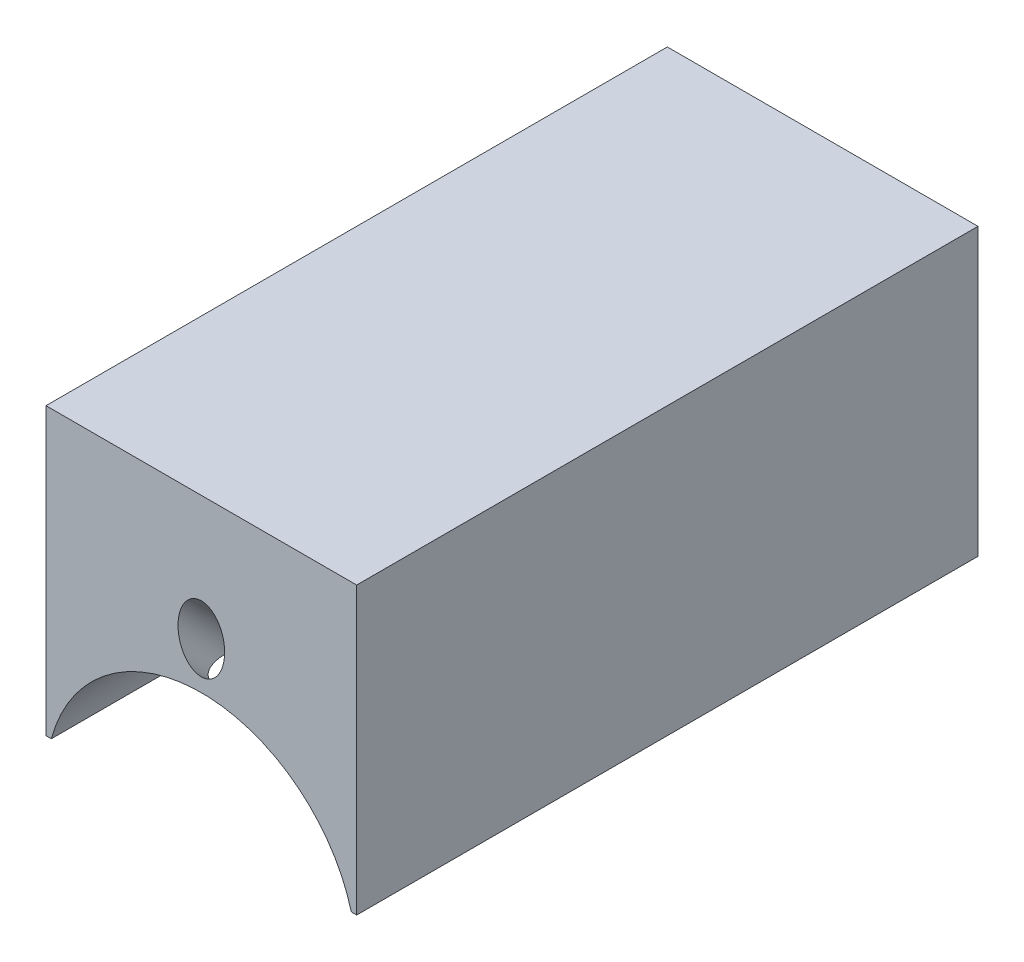
ISO-10303-21;
HEADER;
FILE_DESCRIPTION(('STEP AP214'),'2;1');
FILE_NAME('part.step','',(''),(''),'','','');
FILE_SCHEMA(('AUTOMOTIVE_DESIGN { 1 0 10303 214 1 1 1 1 }'));
ENDSEC;
DATA;
#1=APPLICATION_CONTEXT('core data for automotive mechanical design processes');
#2=APPLICATION_PROTOCOL_DEFINITION('international standard','automotive_design',2000,#1);
#3=PRODUCT_CONTEXT('',#1,'mechanical');
#4=PRODUCT('Part','Part','',(#3));
#5=PRODUCT_RELATED_PRODUCT_CATEGORY('part','',(#4));
#6=PRODUCT_DEFINITION_FORMATION('','',#4);
#7=PRODUCT_DEFINITION_CONTEXT('part definition',#1,'design');
#8=PRODUCT_DEFINITION('design','',#6,#7);
#9=PRODUCT_DEFINITION_SHAPE('','',#8);
#10=(LENGTH_UNIT() NAMED_UNIT(*) SI_UNIT(.MILLI.,.METRE.));
#11=(NAMED_UNIT(*) PLANE_ANGLE_UNIT() SI_UNIT($,.RADIAN.));
#12=(NAMED_UNIT(*) SI_UNIT($,.STERADIAN.) SOLID_ANGLE_UNIT());
#13=UNCERTAINTY_MEASURE_WITH_UNIT(LENGTH_MEASURE(1.E-05),#10,'distance_accuracy_value','');
#14=(GEOMETRIC_REPRESENTATION_CONTEXT(3) GLOBAL_UNCERTAINTY_ASSIGNED_CONTEXT((#13)) GLOBAL_UNIT_ASSIGNED_CONTEXT((#10,
#11,#12)) REPRESENTATION_CONTEXT('',''));
#15=CARTESIAN_POINT('',(0.,0.,0.));
#16=DIRECTION('',(0.,0.,1.));
#17=DIRECTION('',(1.,0.,0.));
#18=AXIS2_PLACEMENT_3D('',#15,#16,#17);
#19=CARTESIAN_POINT('',(0.,-8.55267423014587,40.));
#20=DIRECTION('',(0.,0.,-1.));
#21=DIRECTION('',(-1.,0.,0.));
#22=AXIS2_PLACEMENT_3D('',#19,#20,#21);
#23=CYLINDRICAL_SURFACE('',#22,10.);
#24=CARTESIAN_POINT('',(0.,-8.55267423014587,0.));
#25=DIRECTION('',(0.,0.,1.));
#26=DIRECTION('',(1.,0.,0.));
#27=AXIS2_PLACEMENT_3D('',#24,#25,#26);
#28=CIRCLE('',#27,10.);
#29=CARTESIAN_POINT('',(9.65608616365866,-5.95267423014586,0.));
#30=VERTEX_POINT('',#29);
#31=CARTESIAN_POINT('',(-9.65608616365865,-5.95267423014586,0.));
#32=VERTEX_POINT('',#31);
#33=EDGE_CURVE('E132',#30,#32,#28,.T.);
#34=ORIENTED_EDGE('',*,*,#33,.F.);
#35=DIRECTION('',(0.,0.,-1.));
#36=VECTOR('',#35,1.);
#37=CARTESIAN_POINT('',(9.65608616365866,-5.95267423014586,40.));
#38=LINE('',#37,#36);
#39=CARTESIAN_POINT('',(9.65608616365866,-5.95267423014586,40.));
#40=VERTEX_POINT('',#39);
#41=EDGE_CURVE('E11',#40,#30,#38,.T.);
#42=ORIENTED_EDGE('',*,*,#41,.F.);
#43=CARTESIAN_POINT('',(0.,-8.55267423014587,40.));
#44=DIRECTION('',(0.,0.,1.));
#45=DIRECTION('',(1.,0.,0.));
#46=AXIS2_PLACEMENT_3D('',#43,#44,#45);
#47=CIRCLE('',#46,10.);
#48=CARTESIAN_POINT('',(-9.65608616365865,-5.95267423014586,40.));
#49=VERTEX_POINT('',#48);
#50=EDGE_CURVE('E146',#40,#49,#47,.T.);
#51=ORIENTED_EDGE('',*,*,#50,.T.);
#52=DIRECTION('',(0.,0.,-1.));
#53=VECTOR('',#52,1.);
#54=CARTESIAN_POINT('',(-9.65608616365865,-5.95267423014586,40.));
#55=LINE('',#54,#53);
#56=EDGE_CURVE('E94',#49,#32,#55,.T.);
#57=ORIENTED_EDGE('',*,*,#56,.T.);
#58=EDGE_LOOP('',(#34,#42,#51,#57));
#59=FACE_BOUND('',#58,.T.);
#60=CARTESIAN_POINT('',(0.,1.44732576985414,39.1213203435597));
#61=CARTESIAN_POINT('',(-0.0635989039507122,1.44732544703079,39.1213177514824));
#62=CARTESIAN_POINT('',(-0.127207495527335,1.44671054681537,39.1149278056126));
#63=CARTESIAN_POINT('',(-0.252007458588344,1.44434557128128,39.0900860557695));
#64=CARTESIAN_POINT('',(-0.313196086451996,1.44259424459475,39.0716209551515));
#65=CARTESIAN_POINT('',(-0.430806163939058,1.43821402272902,39.0246357296502));
#66=CARTESIAN_POINT('',(-0.487266234041388,1.43559333478637,38.9962095067688));
#67=CARTESIAN_POINT('',(-0.595237629720515,1.42974135277948,38.9312868516016));
#68=CARTESIAN_POINT('',(-0.646746610227041,1.4265097714961,38.8947866218413));
#69=CARTESIAN_POINT('',(-0.770499010242282,1.41788112581076,38.7945440035535));
#70=CARTESIAN_POINT('',(-0.839313474722218,1.4122422244431,38.7265991010686));
#71=CARTESIAN_POINT('',(-0.96549604851506,1.400809416659,38.5808016468058));
#72=CARTESIAN_POINT('',(-1.02283229707522,1.39501512806165,38.5029224734083));
#73=CARTESIAN_POINT('',(-1.15199733435805,1.38105441570815,38.301307366688));
#74=CARTESIAN_POINT('',(-1.21753240423799,1.3730875089874,38.1735320055996));
#75=CARTESIAN_POINT('',(-1.32782410384219,1.35893180355088,37.909346953767));
#76=CARTESIAN_POINT('',(-1.37255772370532,1.35274497676877,37.7729278902147));
#77=CARTESIAN_POINT('',(-1.44357544218059,1.34264885670791,37.4902818539742));
#78=CARTESIAN_POINT('',(-1.46916883519213,1.33882562187151,37.3438788640023));
#79=CARTESIAN_POINT('',(-1.49921962458894,1.33431600048281,37.0488912121189));
#80=CARTESIAN_POINT('',(-1.50368292825774,1.33362873721714,36.9003071716116));
#81=CARTESIAN_POINT('',(-1.49060258702766,1.33560888327675,36.6124050580763));
#82=CARTESIAN_POINT('',(-1.47427470408232,1.338090987047,36.4730331506718));
#83=CARTESIAN_POINT('',(-1.41972643907828,1.34607184940699,36.198661135986));
#84=CARTESIAN_POINT('',(-1.3815316186422,1.35156708544273,36.0636561183133));
#85=CARTESIAN_POINT('',(-1.29385509243653,1.36333928830061,35.836652460748));
#86=CARTESIAN_POINT('',(-1.2498092575258,1.36905094765061,35.7425287367147));
#87=CARTESIAN_POINT('',(-1.14740716072743,1.38141468826155,35.5624605892978));
#88=CARTESIAN_POINT('',(-1.08907228720269,1.38806535773219,35.476504205201));
#89=CARTESIAN_POINT('',(-0.970931599625779,1.40021756606717,35.3327435647068));
#90=CARTESIAN_POINT('',(-0.913788070937806,1.40568078415448,35.2727559932163));
#91=CARTESIAN_POINT('',(-0.790389337606933,1.41623297005803,35.1628649552634));
#92=CARTESIAN_POINT('',(-0.724136500829066,1.42132203460553,35.1129588765244));
#93=CARTESIAN_POINT('',(-0.582960054864986,1.43057126643691,35.0255137218416));
#94=CARTESIAN_POINT('',(-0.507966051527616,1.43472297076252,34.9880859688728));
#95=CARTESIAN_POINT('',(-0.351975767201318,1.44143252065566,34.9288146523216));
#96=CARTESIAN_POINT('',(-0.270985934476751,1.44399205145683,34.9069546075592));
#97=CARTESIAN_POINT('',(-0.118279769480295,1.44687443190386,34.8824526332029));
#98=CARTESIAN_POINT('',(-0.0469388411341493,1.44746958378891,34.8774681925112));
#99=CARTESIAN_POINT('',(0.0954617096316644,1.44712309428913,34.8803872473091));
#100=CARTESIAN_POINT('',(0.166521430037862,1.44618204623484,34.8882857669779));
#101=CARTESIAN_POINT('',(0.30145603387736,1.4429941545269,34.9155306621796));
#102=CARTESIAN_POINT('',(0.365495624636654,1.44083756375642,34.9340873251046));
#103=CARTESIAN_POINT('',(0.489784997869014,1.43551798384157,34.981046861123));
#104=CARTESIAN_POINT('',(0.550034520494326,1.43235492578349,35.0094504084533));
#105=CARTESIAN_POINT('',(0.669030832286029,1.42510934643393,35.0767932540234));
#106=CARTESIAN_POINT('',(0.727475843243661,1.42098337358806,35.1162581032101));
#107=CARTESIAN_POINT('',(0.838009225096315,1.41230544422218,35.2031923848099));
#108=CARTESIAN_POINT('',(0.890093810088609,1.40775323681585,35.2506665449399));
#109=CARTESIAN_POINT('',(1.00822635626237,1.39661510347023,35.3736036825492));
#110=CARTESIAN_POINT('',(1.07081899692212,1.38998599855067,35.452394230237));
#111=CARTESIAN_POINT('',(1.18236539474258,1.37733924431541,35.6191510550222));
#112=CARTESIAN_POINT('',(1.23129208447275,1.37132282326991,35.7071350743801));
#113=CARTESIAN_POINT('',(1.32984828177012,1.35867019361316,35.9185770894941));
#114=CARTESIAN_POINT('',(1.3746135079915,1.35246008759831,36.0443229970547));
#115=CARTESIAN_POINT('',(1.4435057425282,1.34265113960475,36.3013487756744));
#116=CARTESIAN_POINT('',(1.46760955518643,1.33905523315832,36.4326346932922));
#117=CARTESIAN_POINT('',(1.500800116933,1.33408397802598,36.7308067089444));
#118=CARTESIAN_POINT('',(1.50454467065039,1.33350060340398,36.8982961526749));
#119=CARTESIAN_POINT('',(1.48493696415329,1.33646381662454,37.2319805694423));
#120=CARTESIAN_POINT('',(1.4615255345197,1.34001942283782,37.3981719185381));
#121=CARTESIAN_POINT('',(1.40628414046454,1.34796618216506,37.6434218770942));
#122=CARTESIAN_POINT('',(1.38437037497754,1.35107078481418,37.7248591804733));
#123=CARTESIAN_POINT('',(1.333579724027,1.35803879112015,37.885565036786));
#124=CARTESIAN_POINT('',(1.30470039535893,1.36190246093505,37.9648328178626));
#125=CARTESIAN_POINT('',(1.23981649188425,1.37022456905199,38.1200562299647));
#126=CARTESIAN_POINT('',(1.2038370167079,1.37468089466949,38.1960224099846));
#127=CARTESIAN_POINT('',(1.12427948477597,1.38400531977133,38.3437826439112));
#128=CARTESIAN_POINT('',(1.08070938527137,1.38887298532334,38.4155809629346));
#129=CARTESIAN_POINT('',(0.985569274170823,1.39875451363356,38.553266436578));
#130=CARTESIAN_POINT('',(0.934034200820374,1.40376766373213,38.6191775127868));
#131=CARTESIAN_POINT('',(0.822243321804919,1.41362187247709,38.7431794411968));
#132=CARTESIAN_POINT('',(0.761998823108611,1.41846314426605,38.8012802471465));
#133=CARTESIAN_POINT('',(0.644961283169299,1.42664260268585,38.8963498484845));
#134=CARTESIAN_POINT('',(0.589745308913363,1.43009056788966,38.93523298041));
#135=CARTESIAN_POINT('',(0.473698720935232,1.43626813040057,39.0036108849348));
#136=CARTESIAN_POINT('',(0.412874579943485,1.4389985422011,39.0331163101892));
#137=CARTESIAN_POINT('',(0.293970626233003,1.44315969561941,39.0775994085611));
#138=CARTESIAN_POINT('',(0.236380218018747,1.44470382561044,39.0938579788349));
#139=CARTESIAN_POINT('',(0.11919497524956,1.44678662172946,39.1157155022071));
#140=CARTESIAN_POINT('',(0.0596017417082228,1.44732607238819,39.121322772726));
#141=CARTESIAN_POINT('',(0.,1.44732576985414,39.1213203435597));
#142=B_SPLINE_CURVE_WITH_KNOTS('',3,(#60,#61,#62,#63,#64,#65,#66,#67,#68,#69,#70,#71,#72,#73,
#74,#75,#76,#77,#78,#79,#80,#81,#82,#83,#84,#85,#86,#87,#88,#89,#90,#91,#92,#93,#94,#95,#96,#97,
#98,#99,#100,#101,#102,#103,#104,#105,#106,#107,#108,#109,#110,#111,#112,#113,#114,#115,#116,
#117,#118,#119,#120,#121,#122,#123,#124,#125,#126,#127,#128,#129,#130,#131,#132,#133,#134,#135,
#136,#137,#138,#139,#140,#141),.UNSPECIFIED.,.T.,.F.,(4,2,2,2,2,2,2,2,2,2,2,2,2,2,2,2,2,2,2,2,2,
2,2,2,2,2,2,2,2,2,2,2,2,2,2,2,2,2,2,2,4),(0.,0.190512124971115,0.381234387809703,
0.570205071983641,0.759264825062521,1.04824275186873,1.33801201645226,1.76715501594986,
2.19677159627431,2.64122895645232,3.08556205351434,3.50506683630914,3.92408223225359,
4.23524255199509,4.54593993146282,4.79406458671837,5.04212486619148,5.29234238281924,
5.54229460443785,5.75570246903248,5.96902792804583,6.16827820785541,6.36754213344498,
6.57864081377853,6.78986453972576,7.09073261779102,7.3921924507161,7.79089514401993,
8.19004485919375,8.69017970668592,9.19140633434005,9.44432534483353,9.69733319721722,
9.94946216974214,10.2013284086402,10.4521196536869,10.7025881863443,10.9047270325171,
11.106635430448,11.2853135390257,11.4638520634256),.UNSPECIFIED.);
#143=CARTESIAN_POINT('',(0.,1.44732576985414,39.1213203435597));
#144=VERTEX_POINT('',#143);
#145=EDGE_CURVE('E136',#144,#144,#142,.T.);
#146=ORIENTED_EDGE('',*,*,#145,.F.);
#147=EDGE_LOOP('',(#146));
#148=FACE_BOUND('',#147,.T.);
#149=CARTESIAN_POINT('',(0.,1.44732576985414,5.12132034355953));
#150=CARTESIAN_POINT('',(-0.0705797943787922,1.44732482521736,5.1213157401809));
#151=CARTESIAN_POINT('',(-0.141274718826432,1.44656876366519,5.11497585159828));
#152=CARTESIAN_POINT('',(-0.280513373881052,1.44363465465769,5.08997102586229));
#153=CARTESIAN_POINT('',(-0.349051384974414,1.44145311382899,5.07127580863972));
#154=CARTESIAN_POINT('',(-0.481615941649012,1.43594077665175,5.0227432778649));
#155=CARTESIAN_POINT('',(-0.545662340257673,1.43261547938346,4.99295922299387));
#156=CARTESIAN_POINT('',(-0.668179448887695,1.4251667793847,4.92375235057662));
#157=CARTESIAN_POINT('',(-0.726651611528196,1.42104358543556,4.88433205378529));
#158=CARTESIAN_POINT('',(-0.840756484878758,1.41209448525384,4.79470791260398));
#159=CARTESIAN_POINT('',(-0.895970174886105,1.4072405316568,4.74397661614378));
#160=CARTESIAN_POINT('',(-0.99877203844563,1.39745751596457,4.63533911060007));
#161=CARTESIAN_POINT('',(-1.04635542098706,1.39252840879129,4.57742843378282));
#162=CARTESIAN_POINT('',(-1.15602916547023,1.38050389626877,4.42534977167514));
#163=CARTESIAN_POINT('',(-1.2132784439821,1.37357425182849,4.32766184735295));
#164=CARTESIAN_POINT('',(-1.31130984421856,1.361098807775,4.12423901912908));
#165=CARTESIAN_POINT('',(-1.35205450750913,1.35555616683593,4.01848645062579));
#166=CARTESIAN_POINT('',(-1.42888639091306,1.34481439464321,3.76772902944468));
#167=CARTESIAN_POINT('',(-1.45933434402231,1.34028979481013,3.62097093227329));
#168=CARTESIAN_POINT('',(-1.4964346843674,1.33474165463987,3.32449967459165));
#169=CARTESIAN_POINT('',(-1.50306535184367,1.33372130998446,3.17478394193121));
#170=CARTESIAN_POINT('',(-1.49429820418548,1.33504997269991,2.87324477086722));
#171=CARTESIAN_POINT('',(-1.47848433505117,1.33746261950697,2.72143455599308));
#172=CARTESIAN_POINT('',(-1.42479774377372,1.34534075828118,2.42181342912097));
#173=CARTESIAN_POINT('',(-1.38692823194615,1.35080580595047,2.27400193836341));
#174=CARTESIAN_POINT('',(-1.296527253355,1.36300663947507,2.00979570371474));
#175=CARTESIAN_POINT('',(-1.24740694365564,1.36938838682313,1.89221665056416));
#176=CARTESIAN_POINT('',(-1.13198302781148,1.3832213373031,1.66583469216775));
#177=CARTESIAN_POINT('',(-1.06571009482975,1.3906706209087,1.55701657101386));
#178=CARTESIAN_POINT('',(-0.939989592371174,1.4031737188915,1.3883611242863));
#179=CARTESIAN_POINT('',(-0.885950597523698,1.40817609549037,1.32449442330988));
#180=CARTESIAN_POINT('',(-0.768992308600558,1.41788693424701,1.20540393035115));
#181=CARTESIAN_POINT('',(-0.706086819791478,1.42259583721393,1.15016697840441));
#182=CARTESIAN_POINT('',(-0.586972697628646,1.43021816452875,1.06327689109087));
#183=CARTESIAN_POINT('',(-0.532609588148487,1.43329445514935,1.02912661767973));
#184=CARTESIAN_POINT('',(-0.419026687616125,1.43870396585725,0.969998592993568));
#185=CARTESIAN_POINT('',(-0.359810767487735,1.44103777108283,0.945013616338256));
#186=CARTESIAN_POINT('',(-0.237093077763866,1.44470443231965,0.906082347347869));
#187=CARTESIAN_POINT('',(-0.173554512530288,1.44602709312788,0.892248415326111));
#188=CARTESIAN_POINT('',(-0.0449889017829597,1.44743038118735,0.87757736076684));
#189=CARTESIAN_POINT('',(0.0200367198360851,1.44751215054113,0.876728287106294));
#190=CARTESIAN_POINT('',(0.139209867175572,1.44650757063743,0.887223347652245));
#191=CARTESIAN_POINT('',(0.193528726969669,1.4455942412126,0.896761343728027));
#192=CARTESIAN_POINT('',(0.29988674225944,1.44296990153259,0.924462572215938));
#193=CARTESIAN_POINT('',(0.351924840420955,1.44125852550332,0.942629759774636));
#194=CARTESIAN_POINT('',(0.467771627419075,1.43659408972896,0.992909316277427));
#195=CARTESIAN_POINT('',(0.530462948554269,1.43342294144232,1.02756464692328));
#196=CARTESIAN_POINT('',(0.649391520028595,1.4263968546038,1.10651242541883));
#197=CARTESIAN_POINT('',(0.705616256222998,1.42254062577952,1.15082309432684));
#198=CARTESIAN_POINT('',(0.834924204638136,1.41270515687932,1.26784746063412));
#199=CARTESIAN_POINT('',(0.904452398724175,1.40654178305936,1.34445130545173));
#200=CARTESIAN_POINT('',(1.03077124510953,1.39426230978509,1.50751103494756));
#201=CARTESIAN_POINT('',(1.08753451798741,1.38814633861003,1.5939875079673));
#202=CARTESIAN_POINT('',(1.17568031233803,1.37804410195824,1.74940421920566));
#203=CARTESIAN_POINT('',(1.20978611741808,1.37392675610593,1.81682287279408));
#204=CARTESIAN_POINT('',(1.27209212001025,1.3661343387834,1.95437485777237));
#205=CARTESIAN_POINT('',(1.30028967852357,1.36245946525988,2.02450938574375));
#206=CARTESIAN_POINT('',(1.37642948722542,1.35227992955807,2.2380422116505));
#207=CARTESIAN_POINT('',(1.41591623186612,1.34662067767166,2.38456492732259));
#208=CARTESIAN_POINT('',(1.47386307737701,1.33815907910722,2.68584734358693));
#209=CARTESIAN_POINT('',(1.49171685327903,1.33543933546413,2.84072273901029));
#210=CARTESIAN_POINT('',(1.50373820151827,1.33362114541216,3.15142007597597));
#211=CARTESIAN_POINT('',(1.49792364566674,1.33451996664165,3.30724121464778));
#212=CARTESIAN_POINT('',(1.4636604586687,1.33964214355378,3.5905338384582));
#213=CARTESIAN_POINT('',(1.43906354302435,1.3432985580592,3.71847908370066));
#214=CARTESIAN_POINT('',(1.37008221691931,1.35308775550698,3.96887993134474));
#215=CARTESIAN_POINT('',(1.32572373397755,1.35921729267882,4.09134249618352));
#216=CARTESIAN_POINT('',(1.22876285501093,1.37163351244455,4.29742429748533));
#217=CARTESIAN_POINT('',(1.18079480163425,1.37751882921349,4.38324300723922));
#218=CARTESIAN_POINT('',(1.07178856116792,1.38987454965329,4.54611017524843));
#219=CARTESIAN_POINT('',(1.01076956276556,1.39634408636779,4.62317125774745));
#220=CARTESIAN_POINT('',(0.888594168223324,1.40791800510833,4.75132929707306));
#221=CARTESIAN_POINT('',(0.829698805419265,1.41304670289134,4.80457282999453));
#222=CARTESIAN_POINT('',(0.703845517832438,1.42272420887047,4.90074216725323));
#223=CARTESIAN_POINT('',(0.636885946320266,1.42727289823582,4.94366585887573));
#224=CARTESIAN_POINT('',(0.495642868858751,1.43528736317845,5.01713485568631));
#225=CARTESIAN_POINT('',(0.421301712075089,1.43874356120046,5.04757134462418));
#226=CARTESIAN_POINT('',(0.268180654191143,1.44401980570044,5.09338798440241));
#227=CARTESIAN_POINT('',(0.189416308570432,1.44584524591967,5.10881778508694));
#228=CARTESIAN_POINT('',(0.091762631366367,1.44692180642378,5.11791209807725));
#229=CARTESIAN_POINT('',(0.0734359483015155,1.44707297625772,5.11918862166687));
#230=CARTESIAN_POINT('',(0.036742111320307,1.44727508102766,5.1208933443981));
#231=CARTESIAN_POINT('',(0.0183749573313694,1.44732601578374,5.12132154201706));
#232=CARTESIAN_POINT('',(0.,1.44732576985414,5.12132034355953));
#233=B_SPLINE_CURVE_WITH_KNOTS('',3,(#149,#150,#151,#152,#153,#154,#155,#156,#157,#158,#159,
#160,#161,#162,#163,#164,#165,#166,#167,#168,#169,#170,#171,#172,#173,#174,#175,#176,#177,#178,
#179,#180,#181,#182,#183,#184,#185,#186,#187,#188,#189,#190,#191,#192,#193,#194,#195,#196,#197,
#198,#199,#200,#201,#202,#203,#204,#205,#206,#207,#208,#209,#210,#211,#212,#213,#214,#215,#216,
#217,#218,#219,#220,#221,#222,#223,#224,#225,#226,#227,#228,#229,#230,#231,#232),.UNSPECIFIED.,
.T.,.F.,(4,2,2,2,2,2,2,2,2,2,2,2,2,2,2,2,2,2,2,2,2,2,2,2,2,2,2,2,2,2,2,2,2,2,2,2,2,2,2,2,2,4),
(0.,0.211659630047633,0.423839922403994,0.635014009528669,0.846132914400955,1.07071825866463,
1.29544407078224,1.63387149948758,1.97306276761051,2.42053708010182,2.86841935556035,
3.32471327303963,3.7809407911161,4.16254828750407,4.54347803371068,4.79421589255304,
5.04456757499097,5.23668909924251,5.42865883904117,5.62253954023661,5.81624178498333,
5.98094935528735,6.145732491434,6.35965362988407,6.57398202062309,6.88318809976508,
7.19305119869091,7.41976131748971,7.64657248459535,8.10021114755812,8.56629026548429,
9.03201751525427,9.42168173080004,9.81083619893757,10.1052728203402,10.3992794741547,
10.6370211651337,10.8748114860742,11.114632070921,11.3536564791173,11.4087604890466,
11.4638645978801),.UNSPECIFIED.);
#234=CARTESIAN_POINT('',(0.,1.44732576985414,5.12132034355953));
#235=VERTEX_POINT('',#234);
#236=EDGE_CURVE('E153',#235,#235,#233,.T.);
#237=ORIENTED_EDGE('',*,*,#236,.F.);
#238=EDGE_LOOP('',(#237));
#239=FACE_BOUND('',#238,.T.);
#240=CARTESIAN_POINT('',(0.,1.44732576985414,21.5));
#241=CARTESIAN_POINT('',(0.0837515444816421,1.44732442756711,21.4999965461848));
#242=CARTESIAN_POINT('',(0.167551685082132,1.44626259522454,21.4929619991594));
#243=CARTESIAN_POINT('',(0.332809627994913,1.44212892958601,21.4650168000172));
#244=CARTESIAN_POINT('',(0.414265068974229,1.43905513923887,21.4440926370551));
#245=CARTESIAN_POINT('',(0.572418086221861,1.4312429820494,21.3890074950324));
#246=CARTESIAN_POINT('',(0.649119207826801,1.42650587356334,21.3548565204941));
#247=CARTESIAN_POINT('',(0.795690428635256,1.41589052897138,21.2743116205831));
#248=CARTESIAN_POINT('',(0.865561474725191,1.41001245138187,21.2279193955826));
#249=CARTESIAN_POINT('',(0.997046719562128,1.39771747976866,21.1238227350601));
#250=CARTESIAN_POINT('',(1.0585998322255,1.39129710875746,21.0660415437918));
#251=CARTESIAN_POINT('',(1.17117490668949,1.37866838118653,20.9409723111061));
#252=CARTESIAN_POINT('',(1.22219626272936,1.37246003683919,20.8736837232215));
#253=CARTESIAN_POINT('',(1.31249729499943,1.3609245444414,20.7310993564775));
#254=CARTESIAN_POINT('',(1.35171787037205,1.35560188960445,20.6557657530187));
#255=CARTESIAN_POINT('',(1.41692632171056,1.34648788291682,20.4994871793546));
#256=CARTESIAN_POINT('',(1.44291491889163,1.34269644760863,20.4185425152561));
#257=CARTESIAN_POINT('',(1.48073198798911,1.33710833204088,20.2539819581283));
#258=CARTESIAN_POINT('',(1.49266503640518,1.33529692726665,20.170390606592));
#259=CARTESIAN_POINT('',(1.50235624033932,1.33382925955996,20.0023738340127));
#260=CARTESIAN_POINT('',(1.50011520973796,1.33417287288561,19.9179484611375));
#261=CARTESIAN_POINT('',(1.48160733250788,1.33696295337824,19.7513989198059));
#262=CARTESIAN_POINT('',(1.4654569592775,1.33939195746964,19.6692614735152));
#263=CARTESIAN_POINT('',(1.41977117403734,1.34605185111781,19.5088756311285));
#264=CARTESIAN_POINT('',(1.39023538337812,1.35028279164794,19.4306273451193));
#265=CARTESIAN_POINT('',(1.31849603529737,1.36008912530895,19.2798866287171));
#266=CARTESIAN_POINT('',(1.27624314283198,1.3656697375194,19.2074180309076));
#267=CARTESIAN_POINT('',(1.18030413128955,1.37754284559962,19.0705554042181));
#268=CARTESIAN_POINT('',(1.12661726182478,1.38383538817915,19.0061619057306));
#269=CARTESIAN_POINT('',(1.00869493078248,1.39650050041624,18.8866023392603));
#270=CARTESIAN_POINT('',(0.944359329642004,1.40287324098229,18.8315350097137));
#271=CARTESIAN_POINT('',(0.807307089894188,1.41492224633876,18.7329640654927));
#272=CARTESIAN_POINT('',(0.734590414588171,1.42059850807925,18.6894605014561));
#273=CARTESIAN_POINT('',(0.582754598213686,1.43062092570807,18.6152469135005));
#274=CARTESIAN_POINT('',(0.50363167783678,1.43496628910842,18.5845445081597));
#275=CARTESIAN_POINT('',(0.34127318248706,1.44183067542483,18.5368906103146));
#276=CARTESIAN_POINT('',(0.258037885952599,1.44434982180882,18.5199381881844));
#277=CARTESIAN_POINT('',(0.0906695676436444,1.44726158119286,18.5003967701833));
#278=CARTESIAN_POINT('',(0.0065527318704682,1.44767429075802,18.4976720286207));
#279=CARTESIAN_POINT('',(-0.160936677662285,1.44638138000641,18.506303005311));
#280=CARTESIAN_POINT('',(-0.244309274381879,1.44467582526783,18.5176582876681));
#281=CARTESIAN_POINT('',(-0.40753238743141,1.43935045600748,18.5540141001775));
#282=CARTESIAN_POINT('',(-0.48739796307984,1.43573992193399,18.5789484960308));
#283=CARTESIAN_POINT('',(-0.641814958643001,1.42700812643783,18.6416849974618));
#284=CARTESIAN_POINT('',(-0.716366128795101,1.4218867940698,18.6794877073336));
#285=CARTESIAN_POINT('',(-0.858634979291922,1.41065259454101,18.7672062245639));
#286=CARTESIAN_POINT('',(-0.926299009891568,1.40453278612159,18.8172081400128));
#287=CARTESIAN_POINT('',(-1.05232367317771,1.39200439997579,18.9277858116287));
#288=CARTESIAN_POINT('',(-1.11068376479341,1.38559580548282,18.9883621823247));
#289=CARTESIAN_POINT('',(-1.21693784957196,1.37314841289908,19.1189735331765));
#290=CARTESIAN_POINT('',(-1.26474084747421,1.36711313003002,19.1890829251948));
#291=CARTESIAN_POINT('',(-1.34789129270584,1.35615796090318,19.3364160405118));
#292=CARTESIAN_POINT('',(-1.38323907656436,1.35123804451043,19.4136395715215));
#293=CARTESIAN_POINT('',(-1.44033467323944,1.34309609994059,19.5727375336231));
#294=CARTESIAN_POINT('',(-1.46213037141636,1.33986809991852,19.6545944609712));
#295=CARTESIAN_POINT('',(-1.49165549501586,1.33545959283216,19.8208590154351));
#296=CARTESIAN_POINT('',(-1.49938589183067,1.33427894437185,19.9052664659947));
#297=CARTESIAN_POINT('',(-1.5005378666944,1.33410409596256,20.0733290633158));
#298=CARTESIAN_POINT('',(-1.49410252167313,1.33508803318916,20.1569832417569));
#299=CARTESIAN_POINT('',(-1.46741229544379,1.33908397596588,20.3220052633235));
#300=CARTESIAN_POINT('',(-1.44715743638627,1.34209597826532,20.4033731101134));
#301=CARTESIAN_POINT('',(-1.39345373518665,1.34980103097711,20.5614730822343));
#302=CARTESIAN_POINT('',(-1.36001489324314,1.3544928070149,20.6382086704334));
#303=CARTESIAN_POINT('',(-1.28090667642309,1.36503031543116,20.7850036338024));
#304=CARTESIAN_POINT('',(-1.23523688741502,1.37087608688138,20.8550627828036));
#305=CARTESIAN_POINT('',(-1.13244337659164,1.38313320350352,20.9872430579752));
#306=CARTESIAN_POINT('',(-1.07521369039806,1.38954944867381,21.0492813332471));
#307=CARTESIAN_POINT('',(-0.951148841082834,1.40218365812051,21.1629245547878));
#308=CARTESIAN_POINT('',(-0.884311448350941,1.40840157596173,21.2145270725762));
#309=CARTESIAN_POINT('',(-0.742495707543722,1.41997762775935,21.3060876766074));
#310=CARTESIAN_POINT('',(-0.66747457676476,1.42533084114234,21.3459801092148));
#311=CARTESIAN_POINT('',(-0.511751870248719,1.43452605788374,21.412538516758));
#312=CARTESIAN_POINT('',(-0.431056277096704,1.43836962551171,21.4392181900537));
#313=CARTESIAN_POINT('',(-0.29166572788933,1.4432351624692,21.4725413427101));
#314=CARTESIAN_POINT('',(-0.233831133495279,1.44476126164971,21.4828226015388));
#315=CARTESIAN_POINT('',(-0.117338971600126,1.4468070293331,21.4965530977126));
#316=CARTESIAN_POINT('',(-0.0586814143344173,1.44732671034189,21.5000024199525));
#317=CARTESIAN_POINT('',(0.,1.44732576985414,21.5));
#318=B_SPLINE_CURVE_WITH_KNOTS('',3,(#240,#241,#242,#243,#244,#245,#246,#247,#248,#249,#250,
#251,#252,#253,#254,#255,#256,#257,#258,#259,#260,#261,#262,#263,#264,#265,#266,#267,#268,#269,
#270,#271,#272,#273,#274,#275,#276,#277,#278,#279,#280,#281,#282,#283,#284,#285,#286,#287,#288,
#289,#290,#291,#292,#293,#294,#295,#296,#297,#298,#299,#300,#301,#302,#303,#304,#305,#306,#307,
#308,#309,#310,#311,#312,#313,#314,#315,#316,#317),.UNSPECIFIED.,.T.,.F.,(4,2,2,2,2,2,2,2,2,2,2,
2,2,2,2,2,2,2,2,2,2,2,2,2,2,2,2,2,2,2,2,2,2,2,2,2,2,2,4),(0.,0.251040205031663,
0.502324962929151,0.753420023583239,1.0044802241976,1.25729416136844,1.5101226357258,
1.76419702395375,2.01825756225506,2.27041564605925,2.52255925098983,2.77261177195747,
3.02267136690361,3.27371383476159,3.52477278308535,3.77834291255409,4.03191415238668,
4.28563608984875,4.53934087193402,4.79062058544256,5.04189251991155,5.29195148965949,
5.54202220376274,5.79391188036908,6.0458162002863,6.29981366584673,6.55380426808833,
6.80689223457169,7.05996272137177,7.31048888261065,7.56101464229565,7.81135073984147,
8.0616953146688,8.31444829965721,8.56726003468734,8.82146323384734,9.07540233261442,
9.25129851978809,9.42719252123291),.UNSPECIFIED.);
#319=CARTESIAN_POINT('',(0.,1.44732576985414,21.5));
#320=VERTEX_POINT('',#319);
#321=EDGE_CURVE('E47',#320,#320,#318,.T.);
#322=ORIENTED_EDGE('',*,*,#321,.T.);
#323=EDGE_LOOP('',(#322));
#324=FACE_BOUND('',#323,.T.);
#325=ADVANCED_FACE('F43',(#59,#148,#239,#324),#23,.F.);
#326=CARTESIAN_POINT('',(0.,-5.95267423014586,40.));
#327=DIRECTION('',(0.,1.,0.));
#328=DIRECTION('',(-1.,0.,0.));
#329=AXIS2_PLACEMENT_3D('',#326,#327,#328);
#330=PLANE('',#329);
#331=DIRECTION('',(1.,0.,0.));
#332=VECTOR('',#331,1.);
#333=CARTESIAN_POINT('',(0.,-5.95267423014586,0.));
#334=LINE('',#333,#332);
#335=CARTESIAN_POINT('',(10.,-5.95267423014586,0.));
#336=VERTEX_POINT('',#335);
#337=EDGE_CURVE('E135',#30,#336,#334,.T.);
#338=ORIENTED_EDGE('',*,*,#337,.T.);
#339=DIRECTION('',(0.,0.,-1.));
#340=VECTOR('',#339,1.);
#341=CARTESIAN_POINT('',(10.,-5.95267423014586,40.));
#342=LINE('',#341,#340);
#343=CARTESIAN_POINT('',(10.,-5.95267423014586,40.));
#344=VERTEX_POINT('',#343);
#345=EDGE_CURVE('E57',#344,#336,#342,.T.);
#346=ORIENTED_EDGE('',*,*,#345,.F.);
#347=DIRECTION('',(1.,0.,0.));
#348=VECTOR('',#347,1.);
#349=CARTESIAN_POINT('',(0.,-5.95267423014586,40.));
#350=LINE('',#349,#348);
#351=EDGE_CURVE('E127',#40,#344,#350,.T.);
#352=ORIENTED_EDGE('',*,*,#351,.F.);
#353=ORIENTED_EDGE('',*,*,#41,.T.);
#354=EDGE_LOOP('',(#338,#346,#352,#353));
#355=FACE_BOUND('',#354,.T.);
#356=ADVANCED_FACE('F206',(#355),#330,.F.);
#357=CARTESIAN_POINT('',(10.,0.,40.));
#358=DIRECTION('',(1.,0.,0.));
#359=DIRECTION('',(0.,0.,-1.));
#360=AXIS2_PLACEMENT_3D('',#357,#358,#359);
#361=PLANE('',#360);
#362=DIRECTION('',(0.,-1.,0.));
#363=VECTOR('',#362,1.);
#364=CARTESIAN_POINT('',(10.,0.,0.));
#365=LINE('',#364,#363);
#366=CARTESIAN_POINT('',(10.,12.4473257698541,0.));
#367=VERTEX_POINT('',#366);
#368=EDGE_CURVE('E139',#367,#336,#365,.T.);
#369=ORIENTED_EDGE('',*,*,#368,.F.);
#370=DIRECTION('',(0.,0.,-1.));
#371=VECTOR('',#370,1.);
#372=CARTESIAN_POINT('',(10.,12.4473257698541,40.));
#373=LINE('',#372,#371);
#374=CARTESIAN_POINT('',(10.,12.4473257698541,40.));
#375=VERTEX_POINT('',#374);
#376=EDGE_CURVE('E116',#375,#367,#373,.T.);
#377=ORIENTED_EDGE('',*,*,#376,.F.);
#378=DIRECTION('',(0.,-1.,0.));
#379=VECTOR('',#378,1.);
#380=CARTESIAN_POINT('',(10.,0.,40.));
#381=LINE('',#380,#379);
#382=EDGE_CURVE('E125',#375,#344,#381,.T.);
#383=ORIENTED_EDGE('',*,*,#382,.T.);
#384=ORIENTED_EDGE('',*,*,#345,.T.);
#385=EDGE_LOOP('',(#369,#377,#383,#384));
#386=FACE_BOUND('',#385,.T.);
#387=ADVANCED_FACE('F204',(#386),#361,.T.);
#388=CARTESIAN_POINT('',(0.,12.4473257698541,40.));
#389=DIRECTION('',(0.,1.,0.));
#390=DIRECTION('',(-1.,0.,0.));
#391=AXIS2_PLACEMENT_3D('',#388,#389,#390);
#392=PLANE('',#391);
#393=DIRECTION('',(1.,0.,0.));
#394=VECTOR('',#393,1.);
#395=CARTESIAN_POINT('',(0.,12.4473257698541,0.));
#396=LINE('',#395,#394);
#397=CARTESIAN_POINT('',(-10.,12.4473257698541,0.));
#398=VERTEX_POINT('',#397);
#399=EDGE_CURVE('E115',#398,#367,#396,.T.);
#400=ORIENTED_EDGE('',*,*,#399,.F.);
#401=DIRECTION('',(0.,0.,-1.));
#402=VECTOR('',#401,1.);
#403=CARTESIAN_POINT('',(-10.,12.4473257698541,40.));
#404=LINE('',#403,#402);
#405=CARTESIAN_POINT('',(-10.,12.4473257698541,40.));
#406=VERTEX_POINT('',#405);
#407=EDGE_CURVE('E109',#406,#398,#404,.T.);
#408=ORIENTED_EDGE('',*,*,#407,.F.);
#409=DIRECTION('',(1.,0.,0.));
#410=VECTOR('',#409,1.);
#411=CARTESIAN_POINT('',(0.,12.4473257698541,40.));
#412=LINE('',#411,#410);
#413=EDGE_CURVE('E113',#406,#375,#412,.T.);
#414=ORIENTED_EDGE('',*,*,#413,.T.);
#415=ORIENTED_EDGE('',*,*,#376,.T.);
#416=EDGE_LOOP('',(#400,#408,#414,#415));
#417=FACE_BOUND('',#416,.T.);
#418=ADVANCED_FACE('F111',(#417),#392,.T.);
#419=CARTESIAN_POINT('',(-10.,0.,40.));
#420=DIRECTION('',(1.,0.,0.));
#421=DIRECTION('',(0.,1.,0.));
#422=AXIS2_PLACEMENT_3D('',#419,#420,#421);
#423=PLANE('',#422);
#424=DIRECTION('',(0.,-1.,0.));
#425=VECTOR('',#424,1.);
#426=CARTESIAN_POINT('',(-10.,0.,0.));
#427=LINE('',#426,#425);
#428=CARTESIAN_POINT('',(-10.,-5.95267423014586,0.));
#429=VERTEX_POINT('',#428);
#430=EDGE_CURVE('E87',#398,#429,#427,.T.);
#431=ORIENTED_EDGE('',*,*,#430,.T.);
#432=DIRECTION('',(0.,0.,-1.));
#433=VECTOR('',#432,1.);
#434=CARTESIAN_POINT('',(-10.,-5.95267423014586,40.));
#435=LINE('',#434,#433);
#436=CARTESIAN_POINT('',(-10.,-5.95267423014586,40.));
#437=VERTEX_POINT('',#436);
#438=EDGE_CURVE('E117',#437,#429,#435,.T.);
#439=ORIENTED_EDGE('',*,*,#438,.F.);
#440=DIRECTION('',(0.,-1.,0.));
#441=VECTOR('',#440,1.);
#442=CARTESIAN_POINT('',(-10.,0.,40.));
#443=LINE('',#442,#441);
#444=EDGE_CURVE('E119',#406,#437,#443,.T.);
#445=ORIENTED_EDGE('',*,*,#444,.F.);
#446=ORIENTED_EDGE('',*,*,#407,.T.);
#447=EDGE_LOOP('',(#431,#439,#445,#446));
#448=FACE_BOUND('',#447,.T.);
#449=ADVANCED_FACE('F120',(#448),#423,.F.);
#450=CARTESIAN_POINT('',(0.,-5.95267423014586,40.));
#451=DIRECTION('',(0.,1.,0.));
#452=DIRECTION('',(-1.,0.,0.));
#453=AXIS2_PLACEMENT_3D('',#450,#451,#452);
#454=PLANE('',#453);
#455=DIRECTION('',(1.,0.,0.));
#456=VECTOR('',#455,1.);
#457=CARTESIAN_POINT('',(0.,-5.95267423014586,0.));
#458=LINE('',#457,#456);
#459=EDGE_CURVE('E144',#429,#32,#458,.T.);
#460=ORIENTED_EDGE('',*,*,#459,.T.);
#461=ORIENTED_EDGE('',*,*,#56,.F.);
#462=DIRECTION('',(1.,0.,0.));
#463=VECTOR('',#462,1.);
#464=CARTESIAN_POINT('',(0.,-5.95267423014586,40.));
#465=LINE('',#464,#463);
#466=EDGE_CURVE('E66',#437,#49,#465,.T.);
#467=ORIENTED_EDGE('',*,*,#466,.F.);
#468=ORIENTED_EDGE('',*,*,#438,.T.);
#469=EDGE_LOOP('',(#460,#461,#467,#468));
#470=FACE_BOUND('',#469,.T.);
#471=ADVANCED_FACE('F193',(#470),#454,.F.);
#472=CARTESIAN_POINT('',(0.,0.,40.));
#473=DIRECTION('',(0.,0.,1.));
#474=DIRECTION('',(1.,0.,0.));
#475=AXIS2_PLACEMENT_3D('',#472,#473,#474);
#476=PLANE('',#475);
#477=CARTESIAN_POINT('',(0.,4.44732576985412,40.));
#478=DIRECTION('',(0.,0.,1.));
#479=DIRECTION('',(0.,1.,0.));
#480=AXIS2_PLACEMENT_3D('',#477,#478,#479);
#481=ELLIPSE('',#480,2.12132034355964,1.5);
#482=CARTESIAN_POINT('',(0.,6.56864611341375,40.));
#483=VERTEX_POINT('',#482);
#484=EDGE_CURVE('E151',#483,#483,#481,.T.);
#485=ORIENTED_EDGE('',*,*,#484,.F.);
#486=EDGE_LOOP('',(#485));
#487=FACE_BOUND('',#486,.T.);
#488=ORIENTED_EDGE('',*,*,#50,.F.);
#489=ORIENTED_EDGE('',*,*,#351,.T.);
#490=ORIENTED_EDGE('',*,*,#382,.F.);
#491=ORIENTED_EDGE('',*,*,#413,.F.);
#492=ORIENTED_EDGE('',*,*,#444,.T.);
#493=ORIENTED_EDGE('',*,*,#466,.T.);
#494=EDGE_LOOP('',(#488,#489,#490,#491,#492,#493));
#495=FACE_BOUND('',#494,.T.);
#496=ADVANCED_FACE('F123',(#487,#495),#476,.T.);
#497=CARTESIAN_POINT('',(0.,0.,0.));
#498=DIRECTION('',(0.,0.,1.));
#499=DIRECTION('',(1.,0.,0.));
#500=AXIS2_PLACEMENT_3D('',#497,#498,#499);
#501=PLANE('',#500);
#502=CARTESIAN_POINT('',(0.,4.44732576985413,0.));
#503=DIRECTION('',(0.,0.,1.));
#504=DIRECTION('',(0.,1.,0.));
#505=AXIS2_PLACEMENT_3D('',#502,#503,#504);
#506=ELLIPSE('',#505,2.12132034355967,1.5);
#507=CARTESIAN_POINT('',(0.,6.5686461134138,0.));
#508=VERTEX_POINT('',#507);
#509=EDGE_CURVE('E154',#508,#508,#506,.T.);
#510=ORIENTED_EDGE('',*,*,#509,.T.);
#511=EDGE_LOOP('',(#510));
#512=FACE_BOUND('',#511,.T.);
#513=ORIENTED_EDGE('',*,*,#33,.T.);
#514=ORIENTED_EDGE('',*,*,#459,.F.);
#515=ORIENTED_EDGE('',*,*,#430,.F.);
#516=ORIENTED_EDGE('',*,*,#399,.T.);
#517=ORIENTED_EDGE('',*,*,#368,.T.);
#518=ORIENTED_EDGE('',*,*,#337,.F.);
#519=EDGE_LOOP('',(#513,#514,#515,#516,#517,#518));
#520=FACE_BOUND('',#519,.T.);
#521=ADVANCED_FACE('F189',(#512,#520),#501,.F.);
#522=CARTESIAN_POINT('',(0.,-20.7526742301459,14.7999999999999));
#523=DIRECTION('',(0.,0.707106781186546,0.707106781186549));
#524=DIRECTION('',(0.,-0.707106781186549,0.707106781186546));
#525=AXIS2_PLACEMENT_3D('',#522,#523,#524);
#526=CYLINDRICAL_SURFACE('',#525,1.5);
#527=ORIENTED_EDGE('',*,*,#145,.T.);
#528=EDGE_LOOP('',(#527));
#529=FACE_BOUND('',#528,.T.);
#530=ORIENTED_EDGE('',*,*,#484,.T.);
#531=EDGE_LOOP('',(#530));
#532=FACE_BOUND('',#531,.T.);
#533=ADVANCED_FACE('F182',(#529,#532),#526,.F.);
#534=CARTESIAN_POINT('',(0.,-20.752674230146,25.1999999999995));
#535=DIRECTION('',(0.,0.707106781186556,-0.707106781186539));
#536=DIRECTION('',(0.,0.707106781186539,0.707106781186556));
#537=AXIS2_PLACEMENT_3D('',#534,#535,#536);
#538=CYLINDRICAL_SURFACE('',#537,1.5);
#539=ORIENTED_EDGE('',*,*,#236,.T.);
#540=EDGE_LOOP('',(#539));
#541=FACE_BOUND('',#540,.T.);
#542=ORIENTED_EDGE('',*,*,#509,.F.);
#543=EDGE_LOOP('',(#542));
#544=FACE_BOUND('',#543,.T.);
#545=ADVANCED_FACE('F178',(#541,#544),#538,.F.);
#546=CARTESIAN_POINT('',(0.,-8.55267423014586,20.));
#547=DIRECTION('',(0.,1.,0.));
#548=DIRECTION('',(0.,0.,1.));
#549=AXIS2_PLACEMENT_3D('',#546,#547,#548);
#550=CYLINDRICAL_SURFACE('',#549,1.5);
#551=ORIENTED_EDGE('',*,*,#321,.F.);
#552=EDGE_LOOP('',(#551));
#553=FACE_BOUND('',#552,.T.);
#554=CARTESIAN_POINT('',(0.,3.94732576985414,20.));
#555=DIRECTION('',(0.,-1.,0.));
#556=DIRECTION('',(0.,0.,-1.));
#557=AXIS2_PLACEMENT_3D('',#554,#555,#556);
#558=CIRCLE('',#557,1.5);
#559=CARTESIAN_POINT('',(0.,3.94732576985414,18.5));
#560=VERTEX_POINT('',#559);
#561=EDGE_CURVE('E161',#560,#560,#558,.T.);
#562=ORIENTED_EDGE('',*,*,#561,.F.);
#563=EDGE_LOOP('',(#562));
#564=FACE_BOUND('',#563,.T.);
#565=ADVANCED_FACE('F181',(#553,#564),#550,.F.);
#566=CARTESIAN_POINT('',(0.,3.94732576985414,20.));
#567=DIRECTION('',(0.,-1.,0.));
#568=DIRECTION('',(0.,0.,-1.));
#569=AXIS2_PLACEMENT_3D('',#566,#567,#568);
#570=PLANE('',#569);
#571=ORIENTED_EDGE('',*,*,#561,.T.);
#572=EDGE_LOOP('',(#571));
#573=FACE_BOUND('',#572,.T.);
#574=ADVANCED_FACE('F238',(#573),#570,.T.);
#575=CLOSED_SHELL('',(#325,#356,#387,#418,#449,#471,#496,#521,#533,#545,#565,#574));
#576=MANIFOLD_SOLID_BREP('B2',#575);
#577=ADVANCED_BREP_SHAPE_REPRESENTATION('',(#18,#576),#14);
#578=SHAPE_DEFINITION_REPRESENTATION(#9,#577);
ENDSEC;
END-ISO-10303-21;
